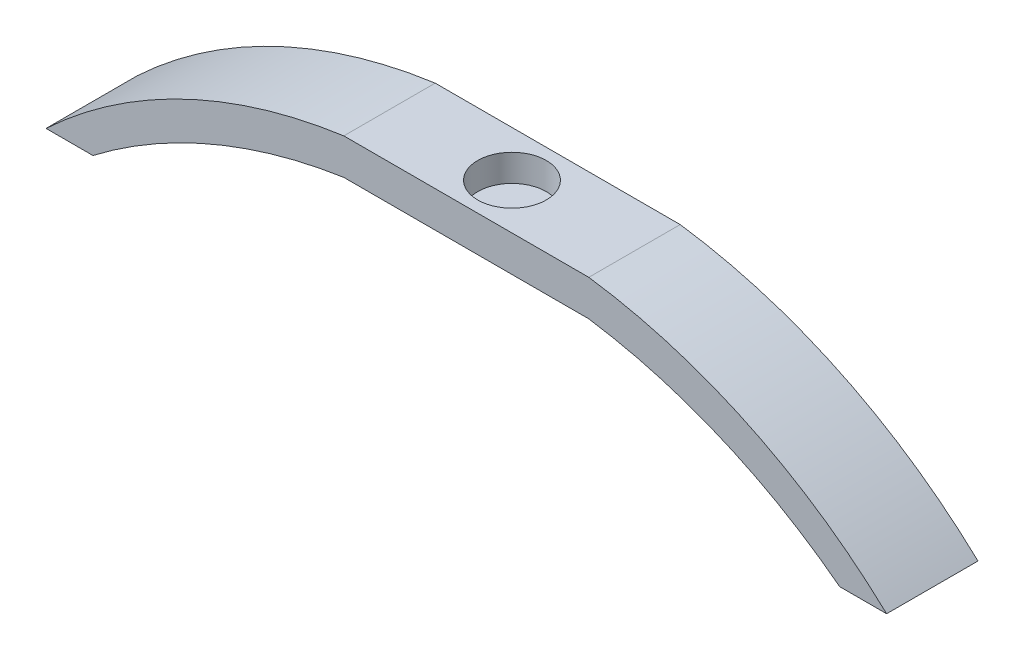
ISO-10303-21;
HEADER;
FILE_DESCRIPTION(('STEP AP214'),'2;1');
FILE_NAME('part.step','',(''),(''),'','','');
FILE_SCHEMA(('AUTOMOTIVE_DESIGN { 1 0 10303 214 1 1 1 1 }'));
ENDSEC;
DATA;
#1=APPLICATION_CONTEXT('core data for automotive mechanical design processes');
#2=APPLICATION_PROTOCOL_DEFINITION('international standard','automotive_design',2000,#1);
#3=PRODUCT_CONTEXT('',#1,'mechanical');
#4=PRODUCT('Part','Part','',(#3));
#5=PRODUCT_RELATED_PRODUCT_CATEGORY('part','',(#4));
#6=PRODUCT_DEFINITION_FORMATION('','',#4);
#7=PRODUCT_DEFINITION_CONTEXT('part definition',#1,'design');
#8=PRODUCT_DEFINITION('design','',#6,#7);
#9=PRODUCT_DEFINITION_SHAPE('','',#8);
#10=(LENGTH_UNIT() NAMED_UNIT(*) SI_UNIT(.MILLI.,.METRE.));
#11=(NAMED_UNIT(*) PLANE_ANGLE_UNIT() SI_UNIT($,.RADIAN.));
#12=(NAMED_UNIT(*) SI_UNIT($,.STERADIAN.) SOLID_ANGLE_UNIT());
#13=UNCERTAINTY_MEASURE_WITH_UNIT(LENGTH_MEASURE(1.E-05),#10,'distance_accuracy_value','');
#14=(GEOMETRIC_REPRESENTATION_CONTEXT(3) GLOBAL_UNCERTAINTY_ASSIGNED_CONTEXT((#13)) GLOBAL_UNIT_ASSIGNED_CONTEXT((#10,
#11,#12)) REPRESENTATION_CONTEXT('',''));
#15=CARTESIAN_POINT('',(0.,0.,0.));
#16=DIRECTION('',(0.,0.,1.));
#17=DIRECTION('',(1.,0.,0.));
#18=AXIS2_PLACEMENT_3D('',#15,#16,#17);
#19=CARTESIAN_POINT('',(-7.62,4.,-5.08));
#20=DIRECTION('',(0.,0.,1.));
#21=DIRECTION('',(1.,0.,0.));
#22=AXIS2_PLACEMENT_3D('',#19,#20,#21);
#23=PLANE('',#22);
#24=DIRECTION('',(-1.,0.,0.));
#25=VECTOR('',#24,1.);
#26=CARTESIAN_POINT('',(-7.62,0.,-5.08));
#27=LINE('',#26,#25);
#28=CARTESIAN_POINT('',(13.62,0.,-5.08));
#29=VERTEX_POINT('',#28);
#30=CARTESIAN_POINT('',(-13.62,0.,-5.08));
#31=VERTEX_POINT('',#30);
#32=EDGE_CURVE('E58',#29,#31,#27,.T.);
#33=ORIENTED_EDGE('',*,*,#32,.T.);
#34=CARTESIAN_POINT('',(-4.65461157428843,-59.9028105382053,-5.08));
#35=DIRECTION('',(0.,0.,1.));
#36=DIRECTION('',(1.,0.,0.));
#37=AXIS2_PLACEMENT_3D('',#34,#35,#36);
#38=CIRCLE('',#37,60.57);
#39=CARTESIAN_POINT('',(-41.5150394498379,-11.84,-5.08000000000002));
#40=VERTEX_POINT('',#39);
#41=EDGE_CURVE('E145',#31,#40,#38,.T.);
#42=ORIENTED_EDGE('',*,*,#41,.T.);
#43=DIRECTION('',(-1.,0.,0.));
#44=VECTOR('',#43,1.);
#45=CARTESIAN_POINT('',(0.,-11.84,-5.08));
#46=LINE('',#45,#44);
#47=CARTESIAN_POINT('',(-46.7350394498379,-11.84,-5.08));
#48=VERTEX_POINT('',#47);
#49=EDGE_CURVE('E152',#40,#48,#46,.T.);
#50=ORIENTED_EDGE('',*,*,#49,.T.);
#51=CARTESIAN_POINT('',(-5.26994310866975,-55.9916781721561,-5.08));
#52=DIRECTION('',(0.,0.,1.));
#53=DIRECTION('',(1.,0.,0.));
#54=AXIS2_PLACEMENT_3D('',#51,#52,#53);
#55=CIRCLE('',#54,60.57);
#56=CARTESIAN_POINT('',(-13.62,4.,-5.08));
#57=VERTEX_POINT('',#56);
#58=EDGE_CURVE('E115',#57,#48,#55,.T.);
#59=ORIENTED_EDGE('',*,*,#58,.F.);
#60=DIRECTION('',(-1.,0.,0.));
#61=VECTOR('',#60,1.);
#62=CARTESIAN_POINT('',(-7.62,4.,-5.08));
#63=LINE('',#62,#61);
#64=CARTESIAN_POINT('',(13.62,4.,-5.08000000000002));
#65=VERTEX_POINT('',#64);
#66=EDGE_CURVE('E50',#65,#57,#63,.T.);
#67=ORIENTED_EDGE('',*,*,#66,.F.);
#68=CARTESIAN_POINT('',(5.26994310866977,-55.9916781721561,-5.08));
#69=DIRECTION('',(0.,0.,1.));
#70=DIRECTION('',(1.,0.,0.));
#71=AXIS2_PLACEMENT_3D('',#68,#69,#70);
#72=CIRCLE('',#71,60.57);
#73=CARTESIAN_POINT('',(46.7350394498379,-11.84,-5.08));
#74=VERTEX_POINT('',#73);
#75=EDGE_CURVE('E66',#65,#74,#72,.F.);
#76=ORIENTED_EDGE('',*,*,#75,.T.);
#77=DIRECTION('',(1.,0.,0.));
#78=VECTOR('',#77,1.);
#79=CARTESIAN_POINT('',(0.,-11.84,-5.08));
#80=LINE('',#79,#78);
#81=CARTESIAN_POINT('',(41.5150394498379,-11.84,-5.08));
#82=VERTEX_POINT('',#81);
#83=EDGE_CURVE('E160',#82,#74,#80,.T.);
#84=ORIENTED_EDGE('',*,*,#83,.F.);
#85=CARTESIAN_POINT('',(4.65461157428845,-59.9028105382053,-5.08));
#86=DIRECTION('',(0.,0.,1.));
#87=DIRECTION('',(1.,0.,0.));
#88=AXIS2_PLACEMENT_3D('',#85,#86,#87);
#89=CIRCLE('',#88,60.57);
#90=EDGE_CURVE('E156',#29,#82,#89,.F.);
#91=ORIENTED_EDGE('',*,*,#90,.F.);
#92=EDGE_LOOP('',(#33,#42,#50,#59,#67,#76,#84,#91));
#93=FACE_BOUND('',#92,.T.);
#94=ADVANCED_FACE('F41',(#93),#23,.F.);
#95=CARTESIAN_POINT('',(-7.62,4.,5.08));
#96=DIRECTION('',(0.,0.,-1.));
#97=DIRECTION('',(-1.,0.,0.));
#98=AXIS2_PLACEMENT_3D('',#95,#96,#97);
#99=PLANE('',#98);
#100=DIRECTION('',(1.,0.,0.));
#101=VECTOR('',#100,1.);
#102=CARTESIAN_POINT('',(-7.62,0.,5.08));
#103=LINE('',#102,#101);
#104=CARTESIAN_POINT('',(-13.62,0.,5.08));
#105=VERTEX_POINT('',#104);
#106=CARTESIAN_POINT('',(13.62,0.,5.08));
#107=VERTEX_POINT('',#106);
#108=EDGE_CURVE('E44',#105,#107,#103,.T.);
#109=ORIENTED_EDGE('',*,*,#108,.T.);
#110=CARTESIAN_POINT('',(4.65461157428845,-59.9028105382053,5.08));
#111=DIRECTION('',(0.,0.,1.));
#112=DIRECTION('',(1.,0.,0.));
#113=AXIS2_PLACEMENT_3D('',#110,#111,#112);
#114=CIRCLE('',#113,60.57);
#115=CARTESIAN_POINT('',(41.5150394498379,-11.84,5.08));
#116=VERTEX_POINT('',#115);
#117=EDGE_CURVE('E170',#116,#107,#114,.T.);
#118=ORIENTED_EDGE('',*,*,#117,.F.);
#119=DIRECTION('',(-1.,0.,0.));
#120=VECTOR('',#119,1.);
#121=CARTESIAN_POINT('',(0.,-11.84,5.08));
#122=LINE('',#121,#120);
#123=CARTESIAN_POINT('',(46.7350394498379,-11.84,5.08));
#124=VERTEX_POINT('',#123);
#125=EDGE_CURVE('E155',#124,#116,#122,.T.);
#126=ORIENTED_EDGE('',*,*,#125,.F.);
#127=CARTESIAN_POINT('',(5.26994310866977,-55.9916781721561,5.08));
#128=DIRECTION('',(0.,0.,1.));
#129=DIRECTION('',(1.,0.,0.));
#130=AXIS2_PLACEMENT_3D('',#127,#128,#129);
#131=CIRCLE('',#130,60.57);
#132=CARTESIAN_POINT('',(13.62,4.,5.08));
#133=VERTEX_POINT('',#132);
#134=EDGE_CURVE('E167',#124,#133,#131,.T.);
#135=ORIENTED_EDGE('',*,*,#134,.T.);
#136=DIRECTION('',(1.,0.,0.));
#137=VECTOR('',#136,1.);
#138=CARTESIAN_POINT('',(-7.62,4.,5.08));
#139=LINE('',#138,#137);
#140=CARTESIAN_POINT('',(-13.62,4.,5.08));
#141=VERTEX_POINT('',#140);
#142=EDGE_CURVE('E11',#141,#133,#139,.T.);
#143=ORIENTED_EDGE('',*,*,#142,.F.);
#144=CARTESIAN_POINT('',(-5.26994310866975,-55.9916781721561,5.08));
#145=DIRECTION('',(0.,0.,1.));
#146=DIRECTION('',(1.,0.,0.));
#147=AXIS2_PLACEMENT_3D('',#144,#145,#146);
#148=CIRCLE('',#147,60.57);
#149=CARTESIAN_POINT('',(-46.7350394498379,-11.84,5.08));
#150=VERTEX_POINT('',#149);
#151=EDGE_CURVE('E113',#150,#141,#148,.F.);
#152=ORIENTED_EDGE('',*,*,#151,.F.);
#153=DIRECTION('',(1.,0.,0.));
#154=VECTOR('',#153,1.);
#155=CARTESIAN_POINT('',(0.,-11.84,5.08));
#156=LINE('',#155,#154);
#157=CARTESIAN_POINT('',(-41.5150394498379,-11.84,5.08));
#158=VERTEX_POINT('',#157);
#159=EDGE_CURVE('E127',#150,#158,#156,.T.);
#160=ORIENTED_EDGE('',*,*,#159,.T.);
#161=CARTESIAN_POINT('',(-4.65461157428843,-59.9028105382053,5.08));
#162=DIRECTION('',(0.,0.,1.));
#163=DIRECTION('',(1.,0.,0.));
#164=AXIS2_PLACEMENT_3D('',#161,#162,#163);
#165=CIRCLE('',#164,60.57);
#166=EDGE_CURVE('E121',#158,#105,#165,.F.);
#167=ORIENTED_EDGE('',*,*,#166,.T.);
#168=EDGE_LOOP('',(#109,#118,#126,#135,#143,#152,#160,#167));
#169=FACE_BOUND('',#168,.T.);
#170=ADVANCED_FACE('F125',(#169),#99,.F.);
#171=CARTESIAN_POINT('',(0.,4.,0.));
#172=DIRECTION('',(0.,1.,0.));
#173=DIRECTION('',(0.,0.,1.));
#174=AXIS2_PLACEMENT_3D('',#171,#172,#173);
#175=PLANE('',#174);
#176=CARTESIAN_POINT('',(0.,4.,0.));
#177=DIRECTION('',(0.,1.,0.));
#178=DIRECTION('',(0.,0.,1.));
#179=AXIS2_PLACEMENT_3D('',#176,#177,#178);
#180=CIRCLE('',#179,3.81);
#181=CARTESIAN_POINT('',(0.,4.,3.81));
#182=VERTEX_POINT('',#181);
#183=EDGE_CURVE('E188',#182,#182,#180,.T.);
#184=ORIENTED_EDGE('',*,*,#183,.F.);
#185=EDGE_LOOP('',(#184));
#186=FACE_BOUND('',#185,.T.);
#187=ORIENTED_EDGE('',*,*,#142,.T.);
#188=DIRECTION('',(0.,0.,1.));
#189=VECTOR('',#188,1.);
#190=CARTESIAN_POINT('',(13.62,4.,-47.2806150566834));
#191=LINE('',#190,#189);
#192=EDGE_CURVE('E180',#65,#133,#191,.T.);
#193=ORIENTED_EDGE('',*,*,#192,.F.);
#194=ORIENTED_EDGE('',*,*,#66,.T.);
#195=DIRECTION('',(0.,0.,1.));
#196=VECTOR('',#195,1.);
#197=CARTESIAN_POINT('',(-13.62,4.,-47.2806150566834));
#198=LINE('',#197,#196);
#199=EDGE_CURVE('E142',#57,#141,#198,.T.);
#200=ORIENTED_EDGE('',*,*,#199,.T.);
#201=EDGE_LOOP('',(#187,#193,#194,#200));
#202=FACE_BOUND('',#201,.T.);
#203=ADVANCED_FACE('F217',(#186,#202),#175,.T.);
#204=CARTESIAN_POINT('',(0.,0.,0.));
#205=DIRECTION('',(0.,1.,0.));
#206=DIRECTION('',(0.,0.,1.));
#207=AXIS2_PLACEMENT_3D('',#204,#205,#206);
#208=PLANE('',#207);
#209=ORIENTED_EDGE('',*,*,#32,.F.);
#210=DIRECTION('',(0.,0.,1.));
#211=VECTOR('',#210,1.);
#212=CARTESIAN_POINT('',(13.62,0.,-47.2806150566834));
#213=LINE('',#212,#211);
#214=EDGE_CURVE('E177',#29,#107,#213,.T.);
#215=ORIENTED_EDGE('',*,*,#214,.T.);
#216=ORIENTED_EDGE('',*,*,#108,.F.);
#217=DIRECTION('',(0.,0.,1.));
#218=VECTOR('',#217,1.);
#219=CARTESIAN_POINT('',(-13.62,0.,-47.2806150566834));
#220=LINE('',#219,#218);
#221=EDGE_CURVE('E146',#31,#105,#220,.T.);
#222=ORIENTED_EDGE('',*,*,#221,.F.);
#223=EDGE_LOOP('',(#209,#215,#216,#222));
#224=FACE_BOUND('',#223,.T.);
#225=ADVANCED_FACE('F205',(#224),#208,.F.);
#226=CARTESIAN_POINT('',(0.,1.,0.));
#227=DIRECTION('',(0.,1.,0.));
#228=DIRECTION('',(0.,0.,1.));
#229=AXIS2_PLACEMENT_3D('',#226,#227,#228);
#230=CYLINDRICAL_SURFACE('',#229,3.81);
#231=CARTESIAN_POINT('',(0.,1.,0.));
#232=DIRECTION('',(0.,1.,0.));
#233=DIRECTION('',(0.,0.,1.));
#234=AXIS2_PLACEMENT_3D('',#231,#232,#233);
#235=CIRCLE('',#234,3.81);
#236=CARTESIAN_POINT('',(0.,1.,3.81));
#237=VERTEX_POINT('',#236);
#238=EDGE_CURVE('E189',#237,#237,#235,.T.);
#239=ORIENTED_EDGE('',*,*,#238,.F.);
#240=EDGE_LOOP('',(#239));
#241=FACE_BOUND('',#240,.T.);
#242=ORIENTED_EDGE('',*,*,#183,.T.);
#243=EDGE_LOOP('',(#242));
#244=FACE_BOUND('',#243,.T.);
#245=ADVANCED_FACE('F244',(#241,#244),#230,.F.);
#246=CARTESIAN_POINT('',(0.,1.,0.));
#247=DIRECTION('',(0.,1.,0.));
#248=DIRECTION('',(0.,0.,1.));
#249=AXIS2_PLACEMENT_3D('',#246,#247,#248);
#250=PLANE('',#249);
#251=ORIENTED_EDGE('',*,*,#238,.T.);
#252=EDGE_LOOP('',(#251));
#253=FACE_BOUND('',#252,.T.);
#254=ADVANCED_FACE('F248',(#253),#250,.T.);
#255=CARTESIAN_POINT('',(0.,-11.84,-47.2806150566834));
#256=DIRECTION('',(0.,1.,0.));
#257=DIRECTION('',(-1.,0.,0.));
#258=AXIS2_PLACEMENT_3D('',#255,#256,#257);
#259=PLANE('',#258);
#260=DIRECTION('',(0.,0.,1.));
#261=VECTOR('',#260,1.);
#262=CARTESIAN_POINT('',(41.5150394498379,-11.84,-47.2806150566834));
#263=LINE('',#262,#261);
#264=EDGE_CURVE('E161',#82,#116,#263,.T.);
#265=ORIENTED_EDGE('',*,*,#264,.F.);
#266=ORIENTED_EDGE('',*,*,#83,.T.);
#267=DIRECTION('',(0.,0.,1.));
#268=VECTOR('',#267,1.);
#269=CARTESIAN_POINT('',(46.7350394498379,-11.84,-47.2806150566834));
#270=LINE('',#269,#268);
#271=EDGE_CURVE('E174',#74,#124,#270,.T.);
#272=ORIENTED_EDGE('',*,*,#271,.T.);
#273=ORIENTED_EDGE('',*,*,#125,.T.);
#274=EDGE_LOOP('',(#265,#266,#272,#273));
#275=FACE_BOUND('',#274,.T.);
#276=ADVANCED_FACE('F210',(#275),#259,.F.);
#277=CARTESIAN_POINT('',(4.65461157428845,-59.9028105382053,-47.2806150566834));
#278=DIRECTION('',(0.,0.,1.));
#279=DIRECTION('',(1.,0.,0.));
#280=AXIS2_PLACEMENT_3D('',#277,#278,#279);
#281=CYLINDRICAL_SURFACE('',#280,60.57);
#282=ORIENTED_EDGE('',*,*,#214,.F.);
#283=ORIENTED_EDGE('',*,*,#90,.T.);
#284=ORIENTED_EDGE('',*,*,#264,.T.);
#285=ORIENTED_EDGE('',*,*,#117,.T.);
#286=EDGE_LOOP('',(#282,#283,#284,#285));
#287=FACE_BOUND('',#286,.T.);
#288=ADVANCED_FACE('F207',(#287),#281,.F.);
#289=CARTESIAN_POINT('',(5.26994310866977,-55.9916781721561,-47.2806150566834));
#290=DIRECTION('',(0.,0.,1.));
#291=DIRECTION('',(1.,0.,0.));
#292=AXIS2_PLACEMENT_3D('',#289,#290,#291);
#293=CYLINDRICAL_SURFACE('',#292,60.57);
#294=ORIENTED_EDGE('',*,*,#75,.F.);
#295=ORIENTED_EDGE('',*,*,#192,.T.);
#296=ORIENTED_EDGE('',*,*,#134,.F.);
#297=ORIENTED_EDGE('',*,*,#271,.F.);
#298=EDGE_LOOP('',(#294,#295,#296,#297));
#299=FACE_BOUND('',#298,.T.);
#300=ADVANCED_FACE('F214',(#299),#293,.T.);
#301=CARTESIAN_POINT('',(-5.26994310866975,-55.9916781721561,-47.2806150566834));
#302=DIRECTION('',(0.,0.,1.));
#303=DIRECTION('',(1.,0.,0.));
#304=AXIS2_PLACEMENT_3D('',#301,#302,#303);
#305=CYLINDRICAL_SURFACE('',#304,60.57);
#306=ORIENTED_EDGE('',*,*,#199,.F.);
#307=ORIENTED_EDGE('',*,*,#58,.T.);
#308=DIRECTION('',(0.,0.,1.));
#309=VECTOR('',#308,1.);
#310=CARTESIAN_POINT('',(-46.7350394498379,-11.84,-47.2806150566834));
#311=LINE('',#310,#309);
#312=EDGE_CURVE('E109',#48,#150,#311,.T.);
#313=ORIENTED_EDGE('',*,*,#312,.T.);
#314=ORIENTED_EDGE('',*,*,#151,.T.);
#315=EDGE_LOOP('',(#306,#307,#313,#314));
#316=FACE_BOUND('',#315,.T.);
#317=ADVANCED_FACE('F112',(#316),#305,.T.);
#318=CARTESIAN_POINT('',(-4.65461157428843,-59.9028105382053,-47.2806150566834));
#319=DIRECTION('',(0.,0.,1.));
#320=DIRECTION('',(1.,0.,0.));
#321=AXIS2_PLACEMENT_3D('',#318,#319,#320);
#322=CYLINDRICAL_SURFACE('',#321,60.57);
#323=ORIENTED_EDGE('',*,*,#41,.F.);
#324=ORIENTED_EDGE('',*,*,#221,.T.);
#325=ORIENTED_EDGE('',*,*,#166,.F.);
#326=DIRECTION('',(0.,0.,1.));
#327=VECTOR('',#326,1.);
#328=CARTESIAN_POINT('',(-41.5150394498379,-11.84,-47.2806150566834));
#329=LINE('',#328,#327);
#330=EDGE_CURVE('E120',#40,#158,#329,.T.);
#331=ORIENTED_EDGE('',*,*,#330,.F.);
#332=EDGE_LOOP('',(#323,#324,#325,#331));
#333=FACE_BOUND('',#332,.T.);
#334=ADVANCED_FACE('F224',(#333),#322,.F.);
#335=CARTESIAN_POINT('',(0.,-11.84,-47.2806150566834));
#336=DIRECTION('',(0.,-1.,0.));
#337=DIRECTION('',(1.,0.,0.));
#338=AXIS2_PLACEMENT_3D('',#335,#336,#337);
#339=PLANE('',#338);
#340=ORIENTED_EDGE('',*,*,#49,.F.);
#341=ORIENTED_EDGE('',*,*,#330,.T.);
#342=ORIENTED_EDGE('',*,*,#159,.F.);
#343=ORIENTED_EDGE('',*,*,#312,.F.);
#344=EDGE_LOOP('',(#340,#341,#342,#343));
#345=FACE_BOUND('',#344,.T.);
#346=ADVANCED_FACE('F132',(#345),#339,.T.);
#347=CLOSED_SHELL('',(#94,#170,#203,#225,#245,#254,#276,#288,#300,#317,#334,#346));
#348=MANIFOLD_SOLID_BREP('B2',#347);
#349=ADVANCED_BREP_SHAPE_REPRESENTATION('',(#18,#348),#14);
#350=SHAPE_DEFINITION_REPRESENTATION(#9,#349);
ENDSEC;
END-ISO-10303-21;
